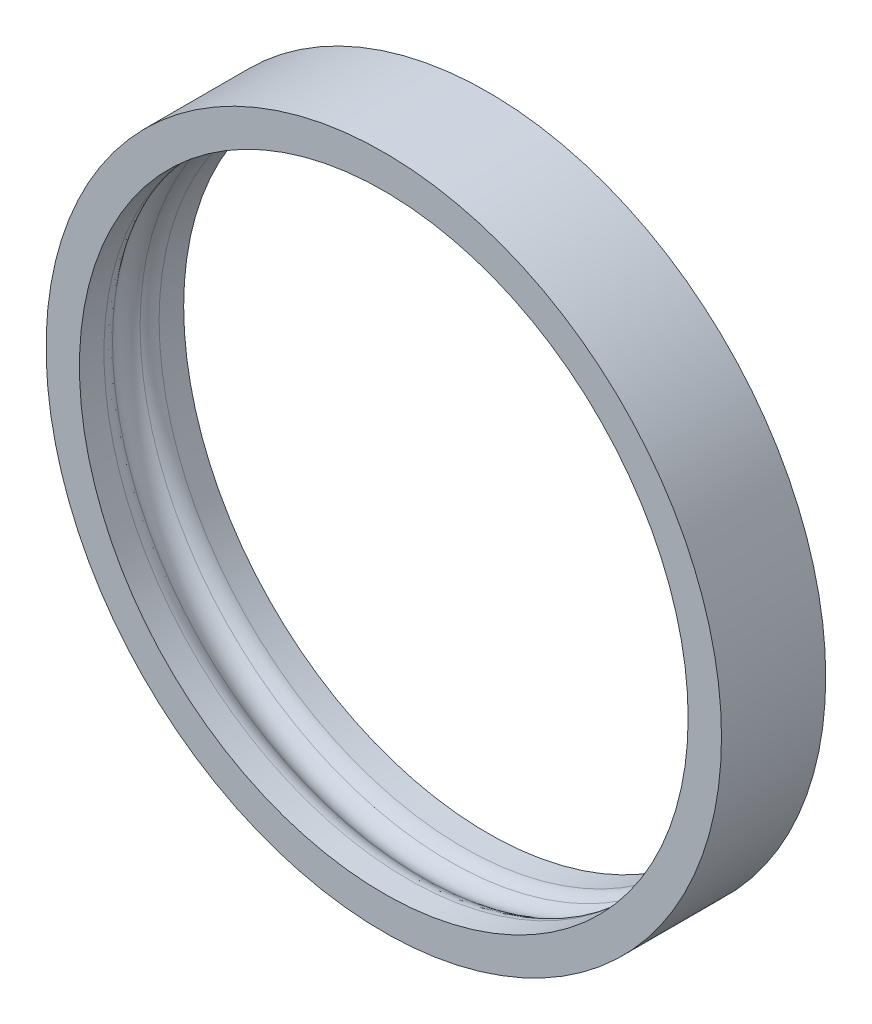
ISO-10303-21;
HEADER;
FILE_DESCRIPTION(('STEP AP214'),'2;1');
FILE_NAME('part.step','',(''),(''),'','','');
FILE_SCHEMA(('AUTOMOTIVE_DESIGN { 1 0 10303 214 1 1 1 1 }'));
ENDSEC;
DATA;
#1=APPLICATION_CONTEXT('core data for automotive mechanical design processes');
#2=APPLICATION_PROTOCOL_DEFINITION('international standard','automotive_design',2000,#1);
#3=PRODUCT_CONTEXT('',#1,'mechanical');
#4=PRODUCT('Part','Part','',(#3));
#5=PRODUCT_RELATED_PRODUCT_CATEGORY('part','',(#4));
#6=PRODUCT_DEFINITION_FORMATION('','',#4);
#7=PRODUCT_DEFINITION_CONTEXT('part definition',#1,'design');
#8=PRODUCT_DEFINITION('design','',#6,#7);
#9=PRODUCT_DEFINITION_SHAPE('','',#8);
#10=(LENGTH_UNIT() NAMED_UNIT(*) SI_UNIT(.MILLI.,.METRE.));
#11=(NAMED_UNIT(*) PLANE_ANGLE_UNIT() SI_UNIT($,.RADIAN.));
#12=(NAMED_UNIT(*) SI_UNIT($,.STERADIAN.) SOLID_ANGLE_UNIT());
#13=UNCERTAINTY_MEASURE_WITH_UNIT(LENGTH_MEASURE(1.E-05),#10,'distance_accuracy_value','');
#14=(GEOMETRIC_REPRESENTATION_CONTEXT(3) GLOBAL_UNCERTAINTY_ASSIGNED_CONTEXT((#13)) GLOBAL_UNIT_ASSIGNED_CONTEXT((#10,
#11,#12)) REPRESENTATION_CONTEXT('',''));
#15=CARTESIAN_POINT('',(0.,0.,0.));
#16=DIRECTION('',(0.,0.,1.));
#17=DIRECTION('',(1.,0.,0.));
#18=AXIS2_PLACEMENT_3D('',#15,#16,#17);
#19=CARTESIAN_POINT('',(0.,0.,2.5));
#20=DIRECTION('',(0.,0.,-1.));
#21=DIRECTION('',(-1.,0.,0.));
#22=AXIS2_PLACEMENT_3D('',#19,#20,#21);
#23=CYLINDRICAL_SURFACE('',#22,14.6);
#24=CARTESIAN_POINT('',(0.,0.,1.32287565553229));
#25=DIRECTION('',(0.,0.,1.));
#26=DIRECTION('',(1.,0.,0.));
#27=AXIS2_PLACEMENT_3D('',#24,#25,#26);
#28=CIRCLE('',#27,14.6);
#29=CARTESIAN_POINT('',(14.6,0.,1.32287565553229));
#30=VERTEX_POINT('',#29);
#31=EDGE_CURVE('E54',#30,#30,#28,.F.);
#32=ORIENTED_EDGE('',*,*,#31,.T.);
#33=EDGE_LOOP('',(#32));
#34=FACE_BOUND('',#33,.T.);
#35=CARTESIAN_POINT('',(0.,0.,2.5));
#36=DIRECTION('',(0.,0.,1.));
#37=DIRECTION('',(1.,0.,0.));
#38=AXIS2_PLACEMENT_3D('',#35,#36,#37);
#39=CIRCLE('',#38,14.6);
#40=CARTESIAN_POINT('',(14.6,0.,2.5));
#41=VERTEX_POINT('',#40);
#42=EDGE_CURVE('E63',#41,#41,#39,.T.);
#43=ORIENTED_EDGE('',*,*,#42,.T.);
#44=EDGE_LOOP('',(#43));
#45=FACE_BOUND('',#44,.T.);
#46=ADVANCED_FACE('F39',(#34,#45),#23,.F.);
#47=CARTESIAN_POINT('',(0.,0.,-1.32287565553229));
#48=DIRECTION('',(0.,0.,-1.));
#49=DIRECTION('',(-1.,0.,0.));
#50=AXIS2_PLACEMENT_3D('',#47,#48,#49);
#51=CIRCLE('',#50,14.6);
#52=CARTESIAN_POINT('',(-14.6,0.,-1.32287565553229));
#53=VERTEX_POINT('',#52);
#54=EDGE_CURVE('E10',#53,#53,#51,.F.);
#55=ORIENTED_EDGE('',*,*,#54,.T.);
#56=EDGE_LOOP('',(#55));
#57=FACE_BOUND('',#56,.T.);
#58=CARTESIAN_POINT('',(0.,0.,-2.5));
#59=DIRECTION('',(0.,0.,1.));
#60=DIRECTION('',(1.,0.,0.));
#61=AXIS2_PLACEMENT_3D('',#58,#59,#60);
#62=CIRCLE('',#61,14.6);
#63=CARTESIAN_POINT('',(14.6,0.,-2.5));
#64=VERTEX_POINT('',#63);
#65=EDGE_CURVE('E66',#64,#64,#62,.T.);
#66=ORIENTED_EDGE('',*,*,#65,.F.);
#67=EDGE_LOOP('',(#66));
#68=FACE_BOUND('',#67,.T.);
#69=ADVANCED_FACE('F76',(#57,#68),#23,.F.);
#70=CARTESIAN_POINT('',(0.,0.,2.5));
#71=DIRECTION('',(0.,0.,1.));
#72=DIRECTION('',(1.,0.,0.));
#73=AXIS2_PLACEMENT_3D('',#70,#71,#72);
#74=PLANE('',#73);
#75=CARTESIAN_POINT('',(0.,0.,2.5));
#76=DIRECTION('',(0.,0.,1.));
#77=DIRECTION('',(1.,0.,0.));
#78=AXIS2_PLACEMENT_3D('',#75,#76,#77);
#79=CIRCLE('',#78,16.2);
#80=CARTESIAN_POINT('',(16.2,0.,2.5));
#81=VERTEX_POINT('',#80);
#82=EDGE_CURVE('E59',#81,#81,#79,.T.);
#83=ORIENTED_EDGE('',*,*,#82,.T.);
#84=EDGE_LOOP('',(#83));
#85=FACE_BOUND('',#84,.T.);
#86=ORIENTED_EDGE('',*,*,#42,.F.);
#87=EDGE_LOOP('',(#86));
#88=FACE_BOUND('',#87,.T.);
#89=ADVANCED_FACE('F73',(#85,#88),#74,.T.);
#90=CARTESIAN_POINT('',(0.,0.,-2.5));
#91=DIRECTION('',(0.,0.,1.));
#92=DIRECTION('',(1.,0.,0.));
#93=AXIS2_PLACEMENT_3D('',#90,#91,#92);
#94=PLANE('',#93);
#95=CARTESIAN_POINT('',(0.,0.,-2.5));
#96=DIRECTION('',(0.,0.,1.));
#97=DIRECTION('',(1.,0.,0.));
#98=AXIS2_PLACEMENT_3D('',#95,#96,#97);
#99=CIRCLE('',#98,16.2);
#100=CARTESIAN_POINT('',(16.2,0.,-2.5));
#101=VERTEX_POINT('',#100);
#102=EDGE_CURVE('E60',#101,#101,#99,.T.);
#103=ORIENTED_EDGE('',*,*,#102,.F.);
#104=EDGE_LOOP('',(#103));
#105=FACE_BOUND('',#104,.T.);
#106=ORIENTED_EDGE('',*,*,#65,.T.);
#107=EDGE_LOOP('',(#106));
#108=FACE_BOUND('',#107,.T.);
#109=ADVANCED_FACE('F75',(#105,#108),#94,.F.);
#110=CARTESIAN_POINT('',(0.,0.,2.5));
#111=DIRECTION('',(0.,0.,-1.));
#112=DIRECTION('',(-1.,0.,0.));
#113=AXIS2_PLACEMENT_3D('',#110,#111,#112);
#114=CYLINDRICAL_SURFACE('',#113,16.2);
#115=ORIENTED_EDGE('',*,*,#82,.F.);
#116=EDGE_LOOP('',(#115));
#117=FACE_BOUND('',#116,.T.);
#118=ORIENTED_EDGE('',*,*,#102,.T.);
#119=EDGE_LOOP('',(#118));
#120=FACE_BOUND('',#119,.T.);
#121=ADVANCED_FACE('F83',(#117,#120),#114,.T.);
#122=CARTESIAN_POINT('',(0.,0.,0.));
#123=DIRECTION('',(0.,0.,1.));
#124=DIRECTION('',(1.,0.,0.));
#125=AXIS2_PLACEMENT_3D('',#122,#123,#124);
#126=TOROIDAL_SURFACE('',#125,14.1,1.);
#127=CARTESIAN_POINT('',(0.,0.,0.66143782776618));
#128=DIRECTION('',(0.,0.,-1.));
#129=DIRECTION('',(-1.,0.,0.));
#130=AXIS2_PLACEMENT_3D('',#127,#128,#129);
#131=CIRCLE('',#130,14.85);
#132=CARTESIAN_POINT('',(-14.85,0.,0.66143782776618));
#133=VERTEX_POINT('',#132);
#134=EDGE_CURVE('E46',#133,#133,#131,.F.);
#135=ORIENTED_EDGE('',*,*,#134,.T.);
#136=EDGE_LOOP('',(#135));
#137=FACE_BOUND('',#136,.T.);
#138=CARTESIAN_POINT('',(0.,0.,-0.661437827766128));
#139=DIRECTION('',(0.,0.,1.));
#140=DIRECTION('',(1.,0.,0.));
#141=AXIS2_PLACEMENT_3D('',#138,#139,#140);
#142=CIRCLE('',#141,14.85);
#143=CARTESIAN_POINT('',(14.85,0.,-0.661437827766128));
#144=VERTEX_POINT('',#143);
#145=EDGE_CURVE('E50',#144,#144,#142,.F.);
#146=ORIENTED_EDGE('',*,*,#145,.T.);
#147=EDGE_LOOP('',(#146));
#148=FACE_BOUND('',#147,.T.);
#149=ADVANCED_FACE('F92',(#137,#148),#126,.F.);
#150=CARTESIAN_POINT('',(0.,0.,1.32287565553229));
#151=DIRECTION('',(0.,0.,1.));
#152=DIRECTION('',(1.,0.,0.));
#153=AXIS2_PLACEMENT_3D('',#150,#151,#152);
#154=TOROIDAL_SURFACE('',#153,15.6,1.);
#155=ORIENTED_EDGE('',*,*,#134,.F.);
#156=EDGE_LOOP('',(#155));
#157=FACE_BOUND('',#156,.T.);
#158=ORIENTED_EDGE('',*,*,#31,.F.);
#159=EDGE_LOOP('',(#158));
#160=FACE_BOUND('',#159,.T.);
#161=ADVANCED_FACE('F94',(#157,#160),#154,.T.);
#162=CARTESIAN_POINT('',(0.,0.,-1.32287565553229));
#163=DIRECTION('',(0.,0.,-1.));
#164=DIRECTION('',(-1.,0.,0.));
#165=AXIS2_PLACEMENT_3D('',#162,#163,#164);
#166=TOROIDAL_SURFACE('',#165,15.6,1.);
#167=ORIENTED_EDGE('',*,*,#145,.F.);
#168=EDGE_LOOP('',(#167));
#169=FACE_BOUND('',#168,.T.);
#170=ORIENTED_EDGE('',*,*,#54,.F.);
#171=EDGE_LOOP('',(#170));
#172=FACE_BOUND('',#171,.T.);
#173=ADVANCED_FACE('F41',(#169,#172),#166,.T.);
#174=CLOSED_SHELL('',(#46,#69,#89,#109,#121,#149,#161,#173));
#175=MANIFOLD_SOLID_BREP('B2',#174);
#176=ADVANCED_BREP_SHAPE_REPRESENTATION('',(#18,#175),#14);
#177=SHAPE_DEFINITION_REPRESENTATION(#9,#176);
ENDSEC;
END-ISO-10303-21;
